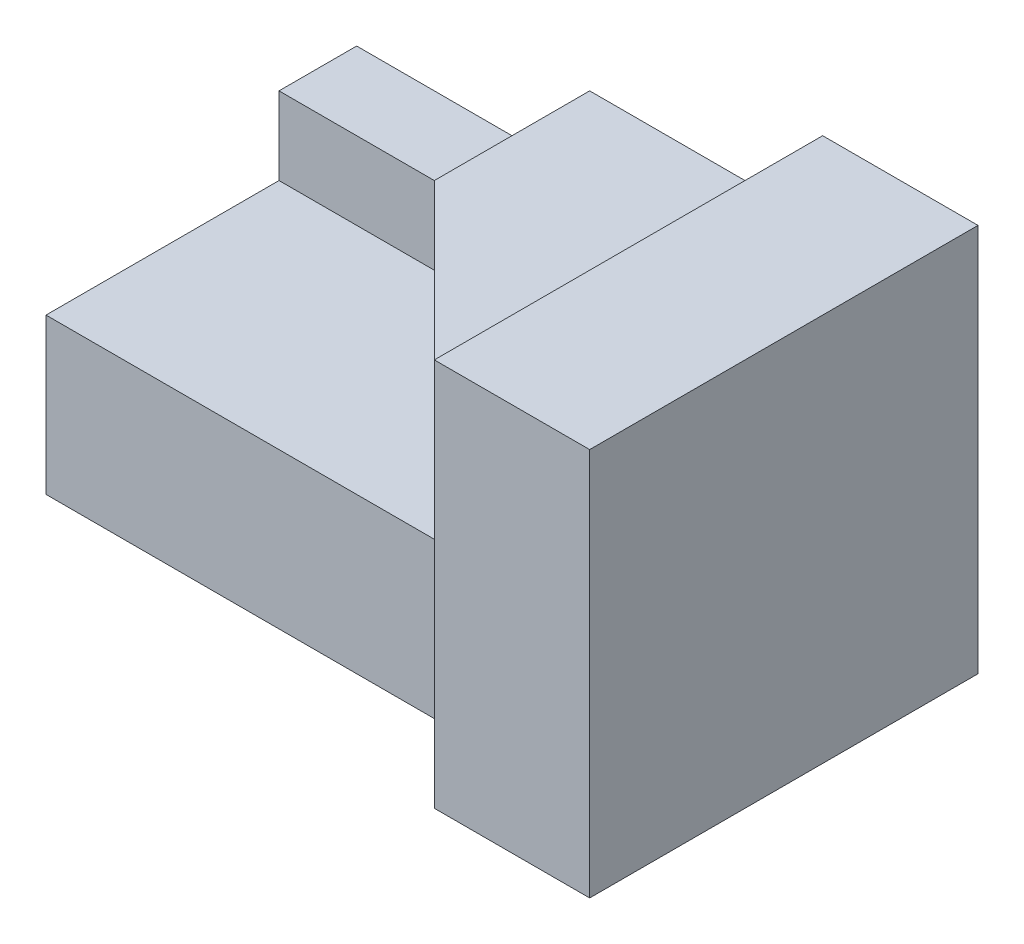
ISO-10303-21;
HEADER;
FILE_DESCRIPTION(('STEP AP214'),'2;1');
FILE_NAME('part.step','',(''),(''),'','','');
FILE_SCHEMA(('AUTOMOTIVE_DESIGN { 1 0 10303 214 1 1 1 1 }'));
ENDSEC;
DATA;
#1=APPLICATION_CONTEXT('core data for automotive mechanical design processes');
#2=APPLICATION_PROTOCOL_DEFINITION('international standard','automotive_design',2000,#1);
#3=PRODUCT_CONTEXT('',#1,'mechanical');
#4=PRODUCT('Part','Part','',(#3));
#5=PRODUCT_RELATED_PRODUCT_CATEGORY('part','',(#4));
#6=PRODUCT_DEFINITION_FORMATION('','',#4);
#7=PRODUCT_DEFINITION_CONTEXT('part definition',#1,'design');
#8=PRODUCT_DEFINITION('design','',#6,#7);
#9=PRODUCT_DEFINITION_SHAPE('','',#8);
#10=(LENGTH_UNIT() NAMED_UNIT(*) SI_UNIT(.MILLI.,.METRE.));
#11=(NAMED_UNIT(*) PLANE_ANGLE_UNIT() SI_UNIT($,.RADIAN.));
#12=(NAMED_UNIT(*) SI_UNIT($,.STERADIAN.) SOLID_ANGLE_UNIT());
#13=UNCERTAINTY_MEASURE_WITH_UNIT(LENGTH_MEASURE(1.E-05),#10,'distance_accuracy_value','');
#14=(GEOMETRIC_REPRESENTATION_CONTEXT(3) GLOBAL_UNCERTAINTY_ASSIGNED_CONTEXT((#13)) GLOBAL_UNIT_ASSIGNED_CONTEXT((#10,
#11,#12)) REPRESENTATION_CONTEXT('',''));
#15=CARTESIAN_POINT('',(0.,0.,0.));
#16=DIRECTION('',(0.,0.,1.));
#17=DIRECTION('',(1.,0.,0.));
#18=AXIS2_PLACEMENT_3D('',#15,#16,#17);
#19=CARTESIAN_POINT('',(0.,50.,-10.));
#20=DIRECTION('',(0.,0.,-1.));
#21=DIRECTION('',(-1.,0.,0.));
#22=AXIS2_PLACEMENT_3D('',#19,#20,#21);
#23=PLANE('',#22);
#24=DIRECTION('',(1.,0.,0.));
#25=VECTOR('',#24,1.);
#26=CARTESIAN_POINT('',(0.,20.,-10.));
#27=LINE('',#26,#25);
#28=CARTESIAN_POINT('',(0.,20.,-10.));
#29=VERTEX_POINT('',#28);
#30=CARTESIAN_POINT('',(50.,20.,-10.));
#31=VERTEX_POINT('',#30);
#32=EDGE_CURVE('E170',#29,#31,#27,.T.);
#33=ORIENTED_EDGE('',*,*,#32,.F.);
#34=DIRECTION('',(0.,-1.,0.));
#35=VECTOR('',#34,1.);
#36=CARTESIAN_POINT('',(0.,50.,-10.));
#37=LINE('',#36,#35);
#38=CARTESIAN_POINT('',(0.,0.,-10.));
#39=VERTEX_POINT('',#38);
#40=EDGE_CURVE('E152',#29,#39,#37,.T.);
#41=ORIENTED_EDGE('',*,*,#40,.T.);
#42=DIRECTION('',(1.,0.,0.));
#43=VECTOR('',#42,1.);
#44=CARTESIAN_POINT('',(0.,0.,-10.));
#45=LINE('',#44,#43);
#46=CARTESIAN_POINT('',(50.,0.,-10.));
#47=VERTEX_POINT('',#46);
#48=EDGE_CURVE('E105',#39,#47,#45,.T.);
#49=ORIENTED_EDGE('',*,*,#48,.T.);
#50=DIRECTION('',(0.,-1.,0.));
#51=VECTOR('',#50,1.);
#52=CARTESIAN_POINT('',(50.,50.,-10.));
#53=LINE('',#52,#51);
#54=EDGE_CURVE('E153',#31,#47,#53,.T.);
#55=ORIENTED_EDGE('',*,*,#54,.F.);
#56=EDGE_LOOP('',(#33,#41,#49,#55));
#57=FACE_BOUND('',#56,.T.);
#58=ADVANCED_FACE('F33',(#57),#23,.F.);
#59=CARTESIAN_POINT('',(0.,0.,-50.));
#60=DIRECTION('',(-1.,0.,0.));
#61=DIRECTION('',(0.,0.,1.));
#62=AXIS2_PLACEMENT_3D('',#59,#60,#61);
#63=PLANE('',#62);
#64=DIRECTION('',(0.,1.,0.));
#65=VECTOR('',#64,1.);
#66=CARTESIAN_POINT('',(0.,20.,-40.));
#67=LINE('',#66,#65);
#68=CARTESIAN_POINT('',(0.,20.,-40.));
#69=VERTEX_POINT('',#68);
#70=CARTESIAN_POINT('',(0.,30.,-40.));
#71=VERTEX_POINT('',#70);
#72=EDGE_CURVE('E173',#69,#71,#67,.T.);
#73=ORIENTED_EDGE('',*,*,#72,.T.);
#74=DIRECTION('',(0.,0.,1.));
#75=VECTOR('',#74,1.);
#76=CARTESIAN_POINT('',(0.,30.,-50.));
#77=LINE('',#76,#75);
#78=CARTESIAN_POINT('',(0.,30.,-50.));
#79=VERTEX_POINT('',#78);
#80=EDGE_CURVE('E92',#79,#71,#77,.T.);
#81=ORIENTED_EDGE('',*,*,#80,.F.);
#82=DIRECTION('',(0.,-1.,0.));
#83=VECTOR('',#82,1.);
#84=CARTESIAN_POINT('',(0.,0.,-50.));
#85=LINE('',#84,#83);
#86=CARTESIAN_POINT('',(0.,0.,-50.));
#87=VERTEX_POINT('',#86);
#88=EDGE_CURVE('E84',#79,#87,#85,.T.);
#89=ORIENTED_EDGE('',*,*,#88,.T.);
#90=DIRECTION('',(0.,0.,1.));
#91=VECTOR('',#90,1.);
#92=CARTESIAN_POINT('',(0.,0.,-50.));
#93=LINE('',#92,#91);
#94=EDGE_CURVE('E89',#87,#39,#93,.T.);
#95=ORIENTED_EDGE('',*,*,#94,.T.);
#96=ORIENTED_EDGE('',*,*,#40,.F.);
#97=DIRECTION('',(0.,0.,1.));
#98=VECTOR('',#97,1.);
#99=CARTESIAN_POINT('',(0.,20.,-40.));
#100=LINE('',#99,#98);
#101=EDGE_CURVE('E182',#69,#29,#100,.T.);
#102=ORIENTED_EDGE('',*,*,#101,.F.);
#103=EDGE_LOOP('',(#73,#81,#89,#95,#96,#102));
#104=FACE_BOUND('',#103,.T.);
#105=ADVANCED_FACE('F35',(#104),#63,.T.);
#106=CARTESIAN_POINT('',(0.,50.,-50.));
#107=DIRECTION('',(0.,1.,0.));
#108=DIRECTION('',(0.,0.,1.));
#109=AXIS2_PLACEMENT_3D('',#106,#107,#108);
#110=PLANE('',#109);
#111=DIRECTION('',(0.,0.,1.));
#112=VECTOR('',#111,1.);
#113=CARTESIAN_POINT('',(60.,50.,-50.));
#114=LINE('',#113,#112);
#115=CARTESIAN_POINT('',(60.,50.,-50.));
#116=VERTEX_POINT('',#115);
#117=CARTESIAN_POINT('',(60.,50.,0.));
#118=VERTEX_POINT('',#117);
#119=EDGE_CURVE('E71',#116,#118,#114,.T.);
#120=ORIENTED_EDGE('',*,*,#119,.T.);
#121=DIRECTION('',(-1.,0.,0.));
#122=VECTOR('',#121,1.);
#123=CARTESIAN_POINT('',(0.,50.,0.));
#124=LINE('',#123,#122);
#125=CARTESIAN_POINT('',(80.,50.,0.));
#126=VERTEX_POINT('',#125);
#127=EDGE_CURVE('E97',#126,#118,#124,.T.);
#128=ORIENTED_EDGE('',*,*,#127,.F.);
#129=DIRECTION('',(0.,0.,1.));
#130=VECTOR('',#129,1.);
#131=CARTESIAN_POINT('',(80.,50.,-50.));
#132=LINE('',#131,#130);
#133=CARTESIAN_POINT('',(80.,50.,-50.));
#134=VERTEX_POINT('',#133);
#135=EDGE_CURVE('E42',#134,#126,#132,.T.);
#136=ORIENTED_EDGE('',*,*,#135,.F.);
#137=DIRECTION('',(-1.,0.,0.));
#138=VECTOR('',#137,1.);
#139=CARTESIAN_POINT('',(0.,50.,-50.));
#140=LINE('',#139,#138);
#141=EDGE_CURVE('E107',#134,#116,#140,.T.);
#142=ORIENTED_EDGE('',*,*,#141,.T.);
#143=EDGE_LOOP('',(#120,#128,#136,#142));
#144=FACE_BOUND('',#143,.T.);
#145=ADVANCED_FACE('F130',(#144),#110,.T.);
#146=CARTESIAN_POINT('',(80.,0.,-50.));
#147=DIRECTION('',(1.,0.,0.));
#148=DIRECTION('',(0.,0.,-1.));
#149=AXIS2_PLACEMENT_3D('',#146,#147,#148);
#150=PLANE('',#149);
#151=DIRECTION('',(0.,1.,0.));
#152=VECTOR('',#151,1.);
#153=CARTESIAN_POINT('',(80.,0.,0.));
#154=LINE('',#153,#152);
#155=CARTESIAN_POINT('',(80.,0.,0.));
#156=VERTEX_POINT('',#155);
#157=EDGE_CURVE('E119',#156,#126,#154,.T.);
#158=ORIENTED_EDGE('',*,*,#157,.F.);
#159=DIRECTION('',(0.,0.,1.));
#160=VECTOR('',#159,1.);
#161=CARTESIAN_POINT('',(80.,0.,-50.));
#162=LINE('',#161,#160);
#163=CARTESIAN_POINT('',(80.,0.,-50.));
#164=VERTEX_POINT('',#163);
#165=EDGE_CURVE('E106',#164,#156,#162,.T.);
#166=ORIENTED_EDGE('',*,*,#165,.F.);
#167=DIRECTION('',(0.,1.,0.));
#168=VECTOR('',#167,1.);
#169=CARTESIAN_POINT('',(80.,0.,-50.));
#170=LINE('',#169,#168);
#171=EDGE_CURVE('E112',#164,#134,#170,.T.);
#172=ORIENTED_EDGE('',*,*,#171,.T.);
#173=ORIENTED_EDGE('',*,*,#135,.T.);
#174=EDGE_LOOP('',(#158,#166,#172,#173));
#175=FACE_BOUND('',#174,.T.);
#176=ADVANCED_FACE('F127',(#175),#150,.T.);
#177=CARTESIAN_POINT('',(0.,0.,-50.));
#178=DIRECTION('',(0.,-1.,0.));
#179=DIRECTION('',(0.,0.,-1.));
#180=AXIS2_PLACEMENT_3D('',#177,#178,#179);
#181=PLANE('',#180);
#182=ORIENTED_EDGE('',*,*,#48,.F.);
#183=ORIENTED_EDGE('',*,*,#94,.F.);
#184=DIRECTION('',(1.,0.,0.));
#185=VECTOR('',#184,1.);
#186=CARTESIAN_POINT('',(0.,0.,-50.));
#187=LINE('',#186,#185);
#188=EDGE_CURVE('E96',#87,#164,#187,.T.);
#189=ORIENTED_EDGE('',*,*,#188,.T.);
#190=ORIENTED_EDGE('',*,*,#165,.T.);
#191=DIRECTION('',(1.,0.,0.));
#192=VECTOR('',#191,1.);
#193=CARTESIAN_POINT('',(0.,0.,0.));
#194=LINE('',#193,#192);
#195=CARTESIAN_POINT('',(60.,0.,0.));
#196=VERTEX_POINT('',#195);
#197=EDGE_CURVE('E62',#196,#156,#194,.T.);
#198=ORIENTED_EDGE('',*,*,#197,.F.);
#199=DIRECTION('',(0.707106781186548,0.,0.707106781186548));
#200=VECTOR('',#199,1.);
#201=CARTESIAN_POINT('',(30.,0.,-30.));
#202=LINE('',#201,#200);
#203=EDGE_CURVE('E157',#47,#196,#202,.T.);
#204=ORIENTED_EDGE('',*,*,#203,.F.);
#205=EDGE_LOOP('',(#182,#183,#189,#190,#198,#204));
#206=FACE_BOUND('',#205,.T.);
#207=ADVANCED_FACE('F102',(#206),#181,.T.);
#208=CARTESIAN_POINT('',(0.,0.,-50.));
#209=DIRECTION('',(0.,0.,-1.));
#210=DIRECTION('',(-1.,0.,0.));
#211=AXIS2_PLACEMENT_3D('',#208,#209,#210);
#212=PLANE('',#211);
#213=DIRECTION('',(0.,1.,0.));
#214=VECTOR('',#213,1.);
#215=CARTESIAN_POINT('',(30.,40.,-50.));
#216=LINE('',#215,#214);
#217=CARTESIAN_POINT('',(30.,30.,-50.));
#218=VERTEX_POINT('',#217);
#219=CARTESIAN_POINT('',(30.,40.,-50.));
#220=VERTEX_POINT('',#219);
#221=EDGE_CURVE('E144',#218,#220,#216,.T.);
#222=ORIENTED_EDGE('',*,*,#221,.T.);
#223=DIRECTION('',(1.,0.,0.));
#224=VECTOR('',#223,1.);
#225=CARTESIAN_POINT('',(0.,40.,-50.));
#226=LINE('',#225,#224);
#227=CARTESIAN_POINT('',(60.,40.,-50.));
#228=VERTEX_POINT('',#227);
#229=EDGE_CURVE('E138',#220,#228,#226,.T.);
#230=ORIENTED_EDGE('',*,*,#229,.T.);
#231=DIRECTION('',(0.,1.,0.));
#232=VECTOR('',#231,1.);
#233=CARTESIAN_POINT('',(60.,50.,-50.));
#234=LINE('',#233,#232);
#235=EDGE_CURVE('E134',#228,#116,#234,.T.);
#236=ORIENTED_EDGE('',*,*,#235,.T.);
#237=ORIENTED_EDGE('',*,*,#141,.F.);
#238=ORIENTED_EDGE('',*,*,#171,.F.);
#239=ORIENTED_EDGE('',*,*,#188,.F.);
#240=ORIENTED_EDGE('',*,*,#88,.F.);
#241=DIRECTION('',(1.,0.,0.));
#242=VECTOR('',#241,1.);
#243=CARTESIAN_POINT('',(0.,30.,-50.));
#244=LINE('',#243,#242);
#245=EDGE_CURVE('E150',#79,#218,#244,.T.);
#246=ORIENTED_EDGE('',*,*,#245,.T.);
#247=EDGE_LOOP('',(#222,#230,#236,#237,#238,#239,#240,#246));
#248=FACE_BOUND('',#247,.T.);
#249=ADVANCED_FACE('F110',(#248),#212,.T.);
#250=CARTESIAN_POINT('',(0.,0.,0.));
#251=DIRECTION('',(0.,0.,-1.));
#252=DIRECTION('',(-1.,0.,0.));
#253=AXIS2_PLACEMENT_3D('',#250,#251,#252);
#254=PLANE('',#253);
#255=DIRECTION('',(0.,1.,0.));
#256=VECTOR('',#255,1.);
#257=CARTESIAN_POINT('',(60.,50.,0.));
#258=LINE('',#257,#256);
#259=CARTESIAN_POINT('',(60.,40.,0.));
#260=VERTEX_POINT('',#259);
#261=EDGE_CURVE('E136',#260,#118,#258,.T.);
#262=ORIENTED_EDGE('',*,*,#261,.F.);
#263=DIRECTION('',(0.,-1.,0.));
#264=VECTOR('',#263,1.);
#265=CARTESIAN_POINT('',(60.,50.,0.));
#266=LINE('',#265,#264);
#267=EDGE_CURVE('E156',#260,#196,#266,.T.);
#268=ORIENTED_EDGE('',*,*,#267,.T.);
#269=ORIENTED_EDGE('',*,*,#197,.T.);
#270=ORIENTED_EDGE('',*,*,#157,.T.);
#271=ORIENTED_EDGE('',*,*,#127,.T.);
#272=EDGE_LOOP('',(#262,#268,#269,#270,#271));
#273=FACE_BOUND('',#272,.T.);
#274=ADVANCED_FACE('F129',(#273),#254,.F.);
#275=CARTESIAN_POINT('',(60.,50.,-50.));
#276=DIRECTION('',(1.,0.,0.));
#277=DIRECTION('',(0.,1.,0.));
#278=AXIS2_PLACEMENT_3D('',#275,#276,#277);
#279=PLANE('',#278);
#280=ORIENTED_EDGE('',*,*,#261,.T.);
#281=ORIENTED_EDGE('',*,*,#119,.F.);
#282=ORIENTED_EDGE('',*,*,#235,.F.);
#283=DIRECTION('',(0.,0.,1.));
#284=VECTOR('',#283,1.);
#285=CARTESIAN_POINT('',(60.,40.,-50.));
#286=LINE('',#285,#284);
#287=EDGE_CURVE('E131',#228,#260,#286,.T.);
#288=ORIENTED_EDGE('',*,*,#287,.T.);
#289=EDGE_LOOP('',(#280,#281,#282,#288));
#290=FACE_BOUND('',#289,.T.);
#291=ADVANCED_FACE('F225',(#290),#279,.F.);
#292=CARTESIAN_POINT('',(0.,40.,-50.));
#293=DIRECTION('',(0.,-1.,0.));
#294=DIRECTION('',(0.,0.,-1.));
#295=AXIS2_PLACEMENT_3D('',#292,#293,#294);
#296=PLANE('',#295);
#297=DIRECTION('',(0.,0.,1.));
#298=VECTOR('',#297,1.);
#299=CARTESIAN_POINT('',(30.,40.,-50.));
#300=LINE('',#299,#298);
#301=CARTESIAN_POINT('',(30.,40.,-30.));
#302=VERTEX_POINT('',#301);
#303=EDGE_CURVE('E139',#220,#302,#300,.T.);
#304=ORIENTED_EDGE('',*,*,#303,.T.);
#305=DIRECTION('',(0.707106781186548,0.,0.707106781186548));
#306=VECTOR('',#305,1.);
#307=CARTESIAN_POINT('',(5.,40.,-55.));
#308=LINE('',#307,#306);
#309=EDGE_CURVE('E11',#302,#260,#308,.T.);
#310=ORIENTED_EDGE('',*,*,#309,.T.);
#311=ORIENTED_EDGE('',*,*,#287,.F.);
#312=ORIENTED_EDGE('',*,*,#229,.F.);
#313=EDGE_LOOP('',(#304,#310,#311,#312));
#314=FACE_BOUND('',#313,.T.);
#315=ADVANCED_FACE('F223',(#314),#296,.F.);
#316=CARTESIAN_POINT('',(30.,40.,-50.));
#317=DIRECTION('',(1.,0.,0.));
#318=DIRECTION('',(0.,0.,-1.));
#319=AXIS2_PLACEMENT_3D('',#316,#317,#318);
#320=PLANE('',#319);
#321=DIRECTION('',(0.,0.,1.));
#322=VECTOR('',#321,1.);
#323=CARTESIAN_POINT('',(30.,30.,-50.));
#324=LINE('',#323,#322);
#325=CARTESIAN_POINT('',(30.,30.,-30.));
#326=VERTEX_POINT('',#325);
#327=EDGE_CURVE('E143',#218,#326,#324,.T.);
#328=ORIENTED_EDGE('',*,*,#327,.T.);
#329=DIRECTION('',(0.,1.,0.));
#330=VECTOR('',#329,1.);
#331=CARTESIAN_POINT('',(30.,20.,-30.));
#332=LINE('',#331,#330);
#333=EDGE_CURVE('E164',#326,#302,#332,.T.);
#334=ORIENTED_EDGE('',*,*,#333,.T.);
#335=ORIENTED_EDGE('',*,*,#303,.F.);
#336=ORIENTED_EDGE('',*,*,#221,.F.);
#337=EDGE_LOOP('',(#328,#334,#335,#336));
#338=FACE_BOUND('',#337,.T.);
#339=ADVANCED_FACE('F217',(#338),#320,.F.);
#340=CARTESIAN_POINT('',(0.,30.,-50.));
#341=DIRECTION('',(0.,-1.,0.));
#342=DIRECTION('',(0.,0.,-1.));
#343=AXIS2_PLACEMENT_3D('',#340,#341,#342);
#344=PLANE('',#343);
#345=ORIENTED_EDGE('',*,*,#80,.T.);
#346=DIRECTION('',(-1.,0.,0.));
#347=VECTOR('',#346,1.);
#348=CARTESIAN_POINT('',(20.,30.,-40.));
#349=LINE('',#348,#347);
#350=CARTESIAN_POINT('',(20.,30.,-40.));
#351=VERTEX_POINT('',#350);
#352=EDGE_CURVE('E179',#351,#71,#349,.T.);
#353=ORIENTED_EDGE('',*,*,#352,.F.);
#354=DIRECTION('',(-0.707106781186547,0.,-0.707106781186548));
#355=VECTOR('',#354,1.);
#356=CARTESIAN_POINT('',(50.,30.,-10.));
#357=LINE('',#356,#355);
#358=EDGE_CURVE('E183',#326,#351,#357,.T.);
#359=ORIENTED_EDGE('',*,*,#358,.F.);
#360=ORIENTED_EDGE('',*,*,#327,.F.);
#361=ORIENTED_EDGE('',*,*,#245,.F.);
#362=EDGE_LOOP('',(#345,#353,#359,#360,#361));
#363=FACE_BOUND('',#362,.T.);
#364=ADVANCED_FACE('F245',(#363),#344,.F.);
#365=CARTESIAN_POINT('',(30.,50.,-30.));
#366=DIRECTION('',(0.707106781186548,0.,-0.707106781186548));
#367=DIRECTION('',(-0.707106781186548,0.,-0.707106781186548));
#368=AXIS2_PLACEMENT_3D('',#365,#366,#367);
#369=PLANE('',#368);
#370=DIRECTION('',(-0.707106781186547,0.,-0.707106781186548));
#371=VECTOR('',#370,1.);
#372=CARTESIAN_POINT('',(30.,20.,-30.));
#373=LINE('',#372,#371);
#374=CARTESIAN_POINT('',(20.,20.,-40.));
#375=VERTEX_POINT('',#374);
#376=EDGE_CURVE('E167',#31,#375,#373,.T.);
#377=ORIENTED_EDGE('',*,*,#376,.F.);
#378=ORIENTED_EDGE('',*,*,#54,.T.);
#379=ORIENTED_EDGE('',*,*,#203,.T.);
#380=ORIENTED_EDGE('',*,*,#267,.F.);
#381=ORIENTED_EDGE('',*,*,#309,.F.);
#382=ORIENTED_EDGE('',*,*,#333,.F.);
#383=ORIENTED_EDGE('',*,*,#358,.T.);
#384=DIRECTION('',(0.,1.,0.));
#385=VECTOR('',#384,1.);
#386=CARTESIAN_POINT('',(20.,20.,-40.));
#387=LINE('',#386,#385);
#388=EDGE_CURVE('E174',#375,#351,#387,.T.);
#389=ORIENTED_EDGE('',*,*,#388,.F.);
#390=EDGE_LOOP('',(#377,#378,#379,#380,#381,#382,#383,#389));
#391=FACE_BOUND('',#390,.T.);
#392=ADVANCED_FACE('F242',(#391),#369,.F.);
#393=CARTESIAN_POINT('',(0.,20.,0.));
#394=DIRECTION('',(0.,1.,0.));
#395=DIRECTION('',(0.,0.,1.));
#396=AXIS2_PLACEMENT_3D('',#393,#394,#395);
#397=PLANE('',#396);
#398=ORIENTED_EDGE('',*,*,#32,.T.);
#399=ORIENTED_EDGE('',*,*,#376,.T.);
#400=DIRECTION('',(-1.,0.,0.));
#401=VECTOR('',#400,1.);
#402=CARTESIAN_POINT('',(20.,20.,-40.));
#403=LINE('',#402,#401);
#404=EDGE_CURVE('E177',#375,#69,#403,.T.);
#405=ORIENTED_EDGE('',*,*,#404,.T.);
#406=ORIENTED_EDGE('',*,*,#101,.T.);
#407=EDGE_LOOP('',(#398,#399,#405,#406));
#408=FACE_BOUND('',#407,.T.);
#409=ADVANCED_FACE('F192',(#408),#397,.T.);
#410=CARTESIAN_POINT('',(20.,20.,-40.));
#411=DIRECTION('',(0.,0.,-1.));
#412=DIRECTION('',(-1.,0.,0.));
#413=AXIS2_PLACEMENT_3D('',#410,#411,#412);
#414=PLANE('',#413);
#415=ORIENTED_EDGE('',*,*,#352,.T.);
#416=ORIENTED_EDGE('',*,*,#72,.F.);
#417=ORIENTED_EDGE('',*,*,#404,.F.);
#418=ORIENTED_EDGE('',*,*,#388,.T.);
#419=EDGE_LOOP('',(#415,#416,#417,#418));
#420=FACE_BOUND('',#419,.T.);
#421=ADVANCED_FACE('F267',(#420),#414,.F.);
#422=CLOSED_SHELL('',(#58,#105,#145,#176,#207,#249,#274,#291,#315,#339,#364,#392,#409,#421));
#423=MANIFOLD_SOLID_BREP('B2',#422);
#424=ADVANCED_BREP_SHAPE_REPRESENTATION('',(#18,#423),#14);
#425=SHAPE_DEFINITION_REPRESENTATION(#9,#424);
ENDSEC;
END-ISO-10303-21;
